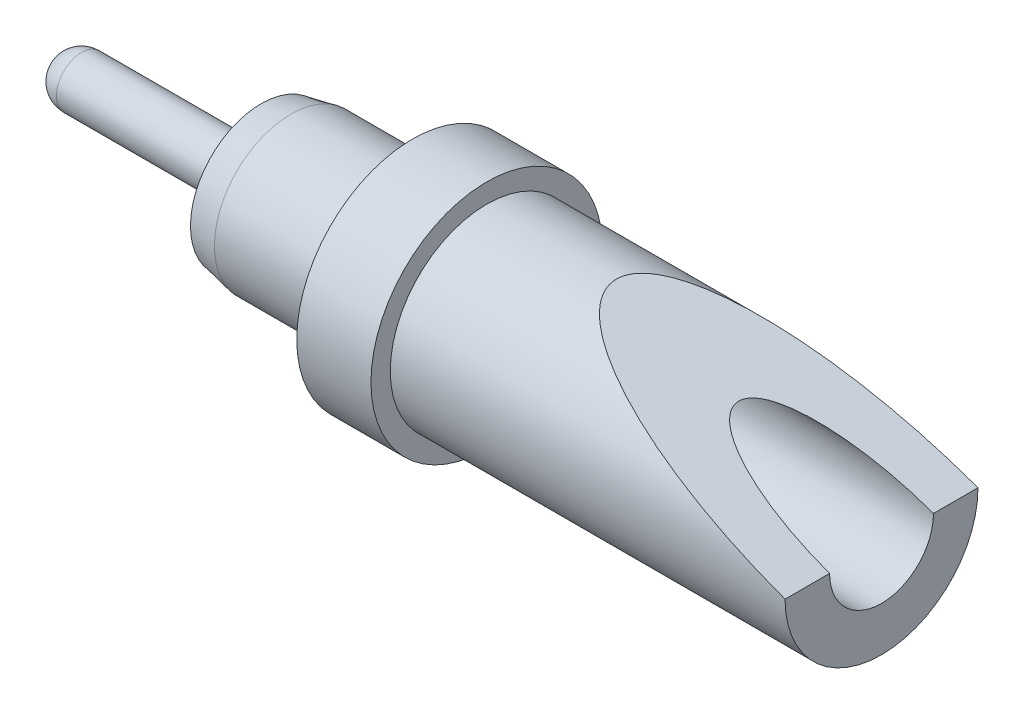
ISO-10303-21;
HEADER;
FILE_DESCRIPTION(('STEP AP214'),'2;1');
FILE_NAME('part.step','',(''),(''),'','','');
FILE_SCHEMA(('AUTOMOTIVE_DESIGN { 1 0 10303 214 1 1 1 1 }'));
ENDSEC;
DATA;
#1=APPLICATION_CONTEXT('core data for automotive mechanical design processes');
#2=APPLICATION_PROTOCOL_DEFINITION('international standard','automotive_design',2000,#1);
#3=PRODUCT_CONTEXT('',#1,'mechanical');
#4=PRODUCT('Part','Part','',(#3));
#5=PRODUCT_RELATED_PRODUCT_CATEGORY('part','',(#4));
#6=PRODUCT_DEFINITION_FORMATION('','',#4);
#7=PRODUCT_DEFINITION_CONTEXT('part definition',#1,'design');
#8=PRODUCT_DEFINITION('design','',#6,#7);
#9=PRODUCT_DEFINITION_SHAPE('','',#8);
#10=(LENGTH_UNIT() NAMED_UNIT(*) SI_UNIT(.MILLI.,.METRE.));
#11=(NAMED_UNIT(*) PLANE_ANGLE_UNIT() SI_UNIT($,.RADIAN.));
#12=(NAMED_UNIT(*) SI_UNIT($,.STERADIAN.) SOLID_ANGLE_UNIT());
#13=UNCERTAINTY_MEASURE_WITH_UNIT(LENGTH_MEASURE(1.E-05),#10,'distance_accuracy_value','');
#14=(GEOMETRIC_REPRESENTATION_CONTEXT(3) GLOBAL_UNCERTAINTY_ASSIGNED_CONTEXT((#13)) GLOBAL_UNIT_ASSIGNED_CONTEXT((#10,
#11,#12)) REPRESENTATION_CONTEXT('',''));
#15=CARTESIAN_POINT('',(0.,0.,0.));
#16=DIRECTION('',(0.,0.,1.));
#17=DIRECTION('',(1.,0.,0.));
#18=AXIS2_PLACEMENT_3D('',#15,#16,#17);
#19=CARTESIAN_POINT('',(7.06120000000001,0.8255,0.));
#20=DIRECTION('',(-1.,0.,0.));
#21=DIRECTION('',(0.,0.,1.));
#22=AXIS2_PLACEMENT_3D('',#19,#20,#21);
#23=PLANE('',#22);
#24=DIRECTION('',(0.,0.,-1.));
#25=VECTOR('',#24,1.);
#26=CARTESIAN_POINT('',(7.06120000000001,0.,0.889));
#27=LINE('',#26,#25);
#28=CARTESIAN_POINT('',(7.06120000000001,0.,0.8255));
#29=VERTEX_POINT('',#28);
#30=CARTESIAN_POINT('',(7.06120000000001,0.,0.4445));
#31=VERTEX_POINT('',#30);
#32=EDGE_CURVE('E48',#29,#31,#27,.T.);
#33=ORIENTED_EDGE('',*,*,#32,.F.);
#34=CARTESIAN_POINT('',(7.06120000000001,0.,0.));
#35=DIRECTION('',(-1.,0.,0.));
#36=DIRECTION('',(0.,0.,1.));
#37=AXIS2_PLACEMENT_3D('',#34,#35,#36);
#38=CIRCLE('',#37,0.8255);
#39=CARTESIAN_POINT('',(7.06120000000001,0.,-0.8255));
#40=VERTEX_POINT('',#39);
#41=EDGE_CURVE('E71',#40,#29,#38,.T.);
#42=ORIENTED_EDGE('',*,*,#41,.F.);
#43=CARTESIAN_POINT('',(7.06120000000001,0.,-0.4445));
#44=VERTEX_POINT('',#43);
#45=EDGE_CURVE('E63',#44,#40,#27,.T.);
#46=ORIENTED_EDGE('',*,*,#45,.F.);
#47=CARTESIAN_POINT('',(7.06120000000001,0.,0.));
#48=DIRECTION('',(1.,0.,0.));
#49=DIRECTION('',(0.,0.,-1.));
#50=AXIS2_PLACEMENT_3D('',#47,#48,#49);
#51=CIRCLE('',#50,0.4445);
#52=EDGE_CURVE('E67',#31,#44,#51,.T.);
#53=ORIENTED_EDGE('',*,*,#52,.F.);
#54=EDGE_LOOP('',(#33,#42,#46,#53));
#55=FACE_BOUND('',#54,.T.);
#56=ADVANCED_FACE('F34',(#55),#23,.F.);
#57=CARTESIAN_POINT('',(0.,0.,0.));
#58=DIRECTION('',(-1.,0.,0.));
#59=DIRECTION('',(0.,0.,1.));
#60=AXIS2_PLACEMENT_3D('',#57,#58,#59);
#61=CYLINDRICAL_SURFACE('',#60,0.8255);
#62=CARTESIAN_POINT('',(3.68300000000001,0.,0.));
#63=DIRECTION('',(-1.,0.,0.));
#64=DIRECTION('',(0.,0.,1.));
#65=AXIS2_PLACEMENT_3D('',#62,#63,#64);
#66=CIRCLE('',#65,0.8255);
#67=CARTESIAN_POINT('',(3.68300000000001,0.,0.8255));
#68=VERTEX_POINT('',#67);
#69=EDGE_CURVE('E76',#68,#68,#66,.T.);
#70=ORIENTED_EDGE('',*,*,#69,.F.);
#71=EDGE_LOOP('',(#70));
#72=FACE_BOUND('',#71,.T.);
#73=CARTESIAN_POINT('',(7.06120000000001,0.,0.));
#74=DIRECTION('',(0.342020143325662,0.939692620785911,0.));
#75=DIRECTION('',(-0.939692620785911,0.342020143325662,0.));
#76=AXIS2_PLACEMENT_3D('',#73,#74,#75);
#77=ELLIPSE('',#76,2.41360053233467,0.8255);
#78=EDGE_CURVE('E60',#40,#29,#77,.T.);
#79=ORIENTED_EDGE('',*,*,#78,.F.);
#80=ORIENTED_EDGE('',*,*,#41,.T.);
#81=EDGE_LOOP('',(#79,#80));
#82=FACE_BOUND('',#81,.T.);
#83=ADVANCED_FACE('F74',(#72,#82),#61,.T.);
#84=CARTESIAN_POINT('',(7.06120000000001,0.,0.));
#85=DIRECTION('',(1.,0.,0.));
#86=DIRECTION('',(0.,0.,-1.));
#87=AXIS2_PLACEMENT_3D('',#84,#85,#86);
#88=CYLINDRICAL_SURFACE('',#87,0.4445);
#89=CARTESIAN_POINT('',(2.48920000000001,0.,0.));
#90=DIRECTION('',(1.,0.,0.));
#91=DIRECTION('',(0.,0.,-1.));
#92=AXIS2_PLACEMENT_3D('',#89,#90,#91);
#93=CIRCLE('',#92,0.444499999999999);
#94=CARTESIAN_POINT('',(2.48920000000001,0.,-0.444499999999999));
#95=VERTEX_POINT('',#94);
#96=EDGE_CURVE('E97',#95,#95,#93,.T.);
#97=ORIENTED_EDGE('',*,*,#96,.F.);
#98=EDGE_LOOP('',(#97));
#99=FACE_BOUND('',#98,.T.);
#100=CARTESIAN_POINT('',(7.06120000000001,0.,0.));
#101=DIRECTION('',(0.342020143325662,0.939692620785911,0.));
#102=DIRECTION('',(0.939692620785911,-0.342020143325662,0.));
#103=AXIS2_PLACEMENT_3D('',#100,#101,#102);
#104=ELLIPSE('',#103,1.29963105587252,0.4445);
#105=EDGE_CURVE('E11',#31,#44,#104,.F.);
#106=ORIENTED_EDGE('',*,*,#105,.F.);
#107=ORIENTED_EDGE('',*,*,#52,.T.);
#108=EDGE_LOOP('',(#106,#107));
#109=FACE_BOUND('',#108,.T.);
#110=ADVANCED_FACE('F91',(#99,#109),#88,.F.);
#111=CARTESIAN_POINT('',(1.67640000000001,0.,0.));
#112=DIRECTION('',(-1.,0.,0.));
#113=DIRECTION('',(0.,0.,1.));
#114=AXIS2_PLACEMENT_3D('',#111,#112,#113);
#115=TOROIDAL_SURFACE('',#114,0.29209999999999,0.0761999999999985);
#116=CARTESIAN_POINT('',(1.67640000000001,0.,0.));
#117=DIRECTION('',(-1.,0.,0.));
#118=DIRECTION('',(0.,0.,1.));
#119=AXIS2_PLACEMENT_3D('',#116,#117,#118);
#120=CIRCLE('',#119,0.215899999999991);
#121=CARTESIAN_POINT('',(1.67640000000001,0.,0.215899999999991));
#122=VERTEX_POINT('',#121);
#123=EDGE_CURVE('E42',#122,#122,#120,.T.);
#124=ORIENTED_EDGE('',*,*,#123,.F.);
#125=EDGE_LOOP('',(#124));
#126=FACE_BOUND('',#125,.T.);
#127=CARTESIAN_POINT('',(1.75260000000001,0.,0.));
#128=DIRECTION('',(-1.,0.,0.));
#129=DIRECTION('',(0.,0.,1.));
#130=AXIS2_PLACEMENT_3D('',#127,#128,#129);
#131=CIRCLE('',#130,0.29209999999999);
#132=CARTESIAN_POINT('',(1.75260000000001,0.,0.29209999999999));
#133=VERTEX_POINT('',#132);
#134=EDGE_CURVE('E94',#133,#133,#131,.T.);
#135=ORIENTED_EDGE('',*,*,#134,.T.);
#136=EDGE_LOOP('',(#135));
#137=FACE_BOUND('',#136,.T.);
#138=ADVANCED_FACE('F36',(#126,#137),#115,.F.);
#139=CARTESIAN_POINT('',(0.,0.,0.));
#140=DIRECTION('',(-1.,0.,0.));
#141=DIRECTION('',(0.,0.,1.));
#142=AXIS2_PLACEMENT_3D('',#139,#140,#141);
#143=CYLINDRICAL_SURFACE('',#142,0.215899999999991);
#144=CARTESIAN_POINT('',(0.215900000000005,0.,0.));
#145=DIRECTION('',(-1.,0.,0.));
#146=DIRECTION('',(0.,0.,1.));
#147=AXIS2_PLACEMENT_3D('',#144,#145,#146);
#148=CIRCLE('',#147,0.215899999999991);
#149=CARTESIAN_POINT('',(0.215900000000005,0.,0.215899999999991));
#150=VERTEX_POINT('',#149);
#151=EDGE_CURVE('E75',#150,#150,#148,.T.);
#152=ORIENTED_EDGE('',*,*,#151,.F.);
#153=EDGE_LOOP('',(#152));
#154=FACE_BOUND('',#153,.T.);
#155=ORIENTED_EDGE('',*,*,#123,.T.);
#156=EDGE_LOOP('',(#155));
#157=FACE_BOUND('',#156,.T.);
#158=ADVANCED_FACE('F87',(#154,#157),#143,.T.);
#159=CARTESIAN_POINT('',(0.215900000000005,0.,0.));
#160=DIRECTION('',(-1.,0.,0.));
#161=DIRECTION('',(0.,1.,0.));
#162=AXIS2_PLACEMENT_3D('',#159,#160,#161);
#163=SPHERICAL_SURFACE('',#162,0.215899999999998);
#164=ORIENTED_EDGE('',*,*,#151,.T.);
#165=EDGE_LOOP('',(#164));
#166=FACE_BOUND('',#165,.T.);
#167=ADVANCED_FACE('F121',(#166),#163,.T.);
#168=CARTESIAN_POINT('',(3.68300000000001,0.9906,0.));
#169=DIRECTION('',(-1.,0.,0.));
#170=DIRECTION('',(0.,0.,1.));
#171=AXIS2_PLACEMENT_3D('',#168,#169,#170);
#172=PLANE('',#171);
#173=CARTESIAN_POINT('',(3.68300000000001,0.,0.));
#174=DIRECTION('',(-1.,0.,0.));
#175=DIRECTION('',(0.,0.,1.));
#176=AXIS2_PLACEMENT_3D('',#173,#174,#175);
#177=CIRCLE('',#176,0.9906);
#178=CARTESIAN_POINT('',(3.68300000000001,0.,0.9906));
#179=VERTEX_POINT('',#178);
#180=EDGE_CURVE('E81',#179,#179,#177,.T.);
#181=ORIENTED_EDGE('',*,*,#180,.F.);
#182=EDGE_LOOP('',(#181));
#183=FACE_BOUND('',#182,.T.);
#184=ORIENTED_EDGE('',*,*,#69,.T.);
#185=EDGE_LOOP('',(#184));
#186=FACE_BOUND('',#185,.T.);
#187=ADVANCED_FACE('F118',(#183,#186),#172,.F.);
#188=CARTESIAN_POINT('',(0.,0.,0.));
#189=DIRECTION('',(-1.,0.,0.));
#190=DIRECTION('',(0.,0.,1.));
#191=AXIS2_PLACEMENT_3D('',#188,#189,#190);
#192=CYLINDRICAL_SURFACE('',#191,0.9906);
#193=CARTESIAN_POINT('',(3.04800000000001,0.,0.));
#194=DIRECTION('',(-1.,0.,0.));
#195=DIRECTION('',(0.,0.,1.));
#196=AXIS2_PLACEMENT_3D('',#193,#194,#195);
#197=CIRCLE('',#196,0.9906);
#198=CARTESIAN_POINT('',(3.04800000000001,0.,0.9906));
#199=VERTEX_POINT('',#198);
#200=EDGE_CURVE('E111',#199,#199,#197,.T.);
#201=ORIENTED_EDGE('',*,*,#200,.F.);
#202=EDGE_LOOP('',(#201));
#203=FACE_BOUND('',#202,.T.);
#204=ORIENTED_EDGE('',*,*,#180,.T.);
#205=EDGE_LOOP('',(#204));
#206=FACE_BOUND('',#205,.T.);
#207=ADVANCED_FACE('F116',(#203,#206),#192,.T.);
#208=CARTESIAN_POINT('',(3.04800000000001,0.654049999999989,0.));
#209=DIRECTION('',(1.,0.,0.));
#210=DIRECTION('',(0.,0.,-1.));
#211=AXIS2_PLACEMENT_3D('',#208,#209,#210);
#212=PLANE('',#211);
#213=CARTESIAN_POINT('',(3.04800000000001,0.,0.));
#214=DIRECTION('',(-1.,0.,0.));
#215=DIRECTION('',(0.,0.,1.));
#216=AXIS2_PLACEMENT_3D('',#213,#214,#215);
#217=CIRCLE('',#216,0.654049999999989);
#218=CARTESIAN_POINT('',(3.04800000000001,0.,0.654049999999989));
#219=VERTEX_POINT('',#218);
#220=EDGE_CURVE('E108',#219,#219,#217,.T.);
#221=ORIENTED_EDGE('',*,*,#220,.F.);
#222=EDGE_LOOP('',(#221));
#223=FACE_BOUND('',#222,.T.);
#224=ORIENTED_EDGE('',*,*,#200,.T.);
#225=EDGE_LOOP('',(#224));
#226=FACE_BOUND('',#225,.T.);
#227=ADVANCED_FACE('F159',(#223,#226),#212,.F.);
#228=CARTESIAN_POINT('',(0.,0.,0.));
#229=DIRECTION('',(-1.,0.,0.));
#230=DIRECTION('',(0.,0.,1.));
#231=AXIS2_PLACEMENT_3D('',#228,#229,#230);
#232=CYLINDRICAL_SURFACE('',#231,0.654049999999989);
#233=CARTESIAN_POINT('',(2.00660000000001,0.,0.));
#234=DIRECTION('',(-1.,0.,0.));
#235=DIRECTION('',(0.,0.,1.));
#236=AXIS2_PLACEMENT_3D('',#233,#234,#235);
#237=CIRCLE('',#236,0.654049999999989);
#238=CARTESIAN_POINT('',(2.00660000000001,0.,0.654049999999989));
#239=VERTEX_POINT('',#238);
#240=EDGE_CURVE('E100',#239,#239,#237,.T.);
#241=ORIENTED_EDGE('',*,*,#240,.F.);
#242=EDGE_LOOP('',(#241));
#243=FACE_BOUND('',#242,.T.);
#244=ORIENTED_EDGE('',*,*,#220,.T.);
#245=EDGE_LOOP('',(#244));
#246=FACE_BOUND('',#245,.T.);
#247=ADVANCED_FACE('F166',(#243,#246),#232,.T.);
#248=CARTESIAN_POINT('',(2.00660000000001,0.,0.));
#249=DIRECTION('',(1.,0.,0.));
#250=DIRECTION('',(0.,0.,-1.));
#251=AXIS2_PLACEMENT_3D('',#248,#249,#250);
#252=CONICAL_SURFACE('',#251,0.654049999999989,0.191986217719378);
#253=CARTESIAN_POINT('',(1.75260000000001,0.,0.));
#254=DIRECTION('',(-1.,0.,0.));
#255=DIRECTION('',(0.,0.,1.));
#256=AXIS2_PLACEMENT_3D('',#253,#254,#255);
#257=CIRCLE('',#256,0.604677401479009);
#258=CARTESIAN_POINT('',(1.75260000000001,0.,0.604677401479009));
#259=VERTEX_POINT('',#258);
#260=EDGE_CURVE('E96',#259,#259,#257,.T.);
#261=ORIENTED_EDGE('',*,*,#260,.F.);
#262=EDGE_LOOP('',(#261));
#263=FACE_BOUND('',#262,.T.);
#264=ORIENTED_EDGE('',*,*,#240,.T.);
#265=EDGE_LOOP('',(#264));
#266=FACE_BOUND('',#265,.T.);
#267=ADVANCED_FACE('F174',(#263,#266),#252,.T.);
#268=CARTESIAN_POINT('',(1.75260000000001,0.29209999999999,0.));
#269=DIRECTION('',(1.,0.,0.));
#270=DIRECTION('',(0.,0.,-1.));
#271=AXIS2_PLACEMENT_3D('',#268,#269,#270);
#272=PLANE('',#271);
#273=ORIENTED_EDGE('',*,*,#134,.F.);
#274=EDGE_LOOP('',(#273));
#275=FACE_BOUND('',#274,.T.);
#276=ORIENTED_EDGE('',*,*,#260,.T.);
#277=EDGE_LOOP('',(#276));
#278=FACE_BOUND('',#277,.T.);
#279=ADVANCED_FACE('F182',(#275,#278),#272,.F.);
#280=CARTESIAN_POINT('',(2.48920000000001,0.,0.));
#281=DIRECTION('',(1.,0.,0.));
#282=DIRECTION('',(0.,0.,-1.));
#283=AXIS2_PLACEMENT_3D('',#280,#281,#282);
#284=CONICAL_SURFACE('',#283,0.444499999999999,1.02974425867666);
#285=CARTESIAN_POINT('',(2.22211745484226,0.,0.));
#286=VERTEX_POINT('',#285);
#287=VERTEX_LOOP('',#286);
#288=FACE_BOUND('',#287,.T.);
#289=ORIENTED_EDGE('',*,*,#96,.T.);
#290=EDGE_LOOP('',(#289));
#291=FACE_BOUND('',#290,.T.);
#292=ADVANCED_FACE('F190',(#288,#291),#284,.F.);
#293=CARTESIAN_POINT('',(7.06120000000001,0.,0.889));
#294=DIRECTION('',(0.342020143325662,0.939692620785911,0.));
#295=DIRECTION('',(-0.939692620785911,0.342020143325662,0.));
#296=AXIS2_PLACEMENT_3D('',#293,#294,#295);
#297=PLANE('',#296);
#298=ORIENTED_EDGE('',*,*,#78,.T.);
#299=ORIENTED_EDGE('',*,*,#32,.T.);
#300=ORIENTED_EDGE('',*,*,#105,.T.);
#301=ORIENTED_EDGE('',*,*,#45,.T.);
#302=EDGE_LOOP('',(#298,#299,#300,#301));
#303=FACE_BOUND('',#302,.T.);
#304=ADVANCED_FACE('F61',(#303),#297,.T.);
#305=CLOSED_SHELL('',(#56,#83,#110,#138,#158,#167,#187,#207,#227,#247,#267,#279,#292,#304));
#306=MANIFOLD_SOLID_BREP('B2',#305);
#307=ADVANCED_BREP_SHAPE_REPRESENTATION('',(#18,#306),#14);
#308=SHAPE_DEFINITION_REPRESENTATION(#9,#307);
ENDSEC;
END-ISO-10303-21;
